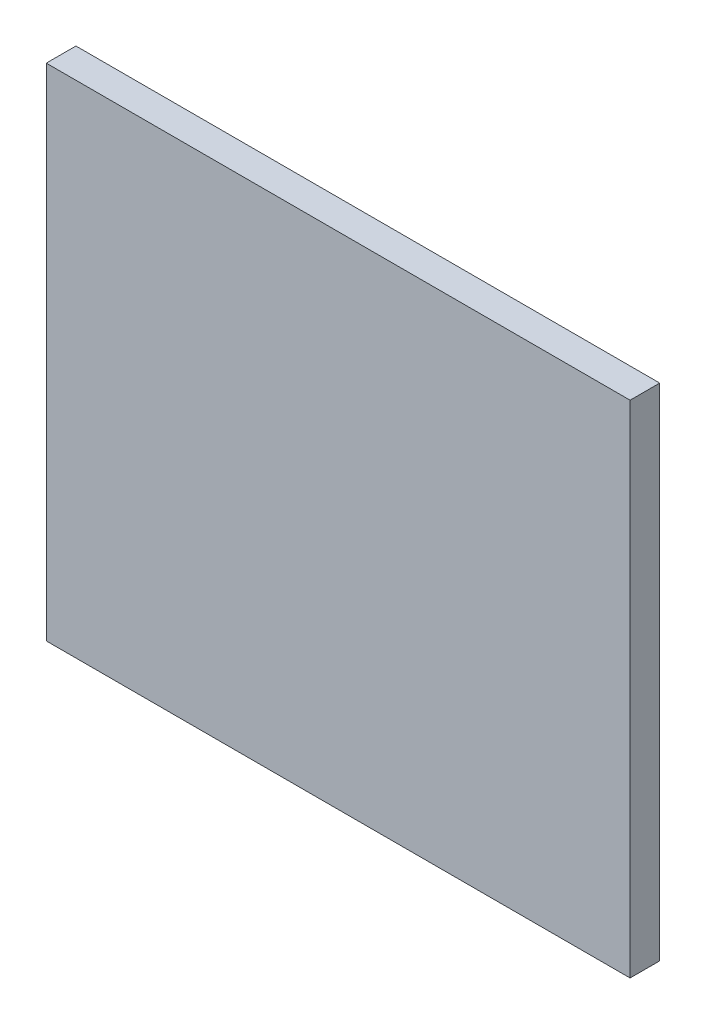
ISO-10303-21;
HEADER;
FILE_DESCRIPTION(('STEP AP214'),'2;1');
FILE_NAME('part.step','',(''),(''),'','','');
FILE_SCHEMA(('AUTOMOTIVE_DESIGN { 1 0 10303 214 1 1 1 1 }'));
ENDSEC;
DATA;
#1=APPLICATION_CONTEXT('core data for automotive mechanical design processes');
#2=APPLICATION_PROTOCOL_DEFINITION('international standard','automotive_design',2000,#1);
#3=PRODUCT_CONTEXT('',#1,'mechanical');
#4=PRODUCT('Part','Part','',(#3));
#5=PRODUCT_RELATED_PRODUCT_CATEGORY('part','',(#4));
#6=PRODUCT_DEFINITION_FORMATION('','',#4);
#7=PRODUCT_DEFINITION_CONTEXT('part definition',#1,'design');
#8=PRODUCT_DEFINITION('design','',#6,#7);
#9=PRODUCT_DEFINITION_SHAPE('','',#8);
#10=(LENGTH_UNIT() NAMED_UNIT(*) SI_UNIT(.MILLI.,.METRE.));
#11=(NAMED_UNIT(*) PLANE_ANGLE_UNIT() SI_UNIT($,.RADIAN.));
#12=(NAMED_UNIT(*) SI_UNIT($,.STERADIAN.) SOLID_ANGLE_UNIT());
#13=UNCERTAINTY_MEASURE_WITH_UNIT(LENGTH_MEASURE(1.E-05),#10,'distance_accuracy_value','');
#14=(GEOMETRIC_REPRESENTATION_CONTEXT(3) GLOBAL_UNCERTAINTY_ASSIGNED_CONTEXT((#13)) GLOBAL_UNIT_ASSIGNED_CONTEXT((#10,
#11,#12)) REPRESENTATION_CONTEXT('',''));
#15=CARTESIAN_POINT('',(0.,0.,0.));
#16=DIRECTION('',(0.,0.,1.));
#17=DIRECTION('',(1.,0.,0.));
#18=AXIS2_PLACEMENT_3D('',#15,#16,#17);
#19=CARTESIAN_POINT('',(97.9169998168945,85.3870010375977,0.));
#20=DIRECTION('',(0.,1.,0.));
#21=DIRECTION('',(1.,0.,0.));
#22=AXIS2_PLACEMENT_3D('',#19,#20,#21);
#23=PLANE('',#22);
#24=DIRECTION('',(1.,0.,0.));
#25=VECTOR('',#24,1.);
#26=CARTESIAN_POINT('',(97.9169998168945,85.3870010375977,0.03556));
#27=LINE('',#26,#25);
#28=CARTESIAN_POINT('',(97.9169998168945,85.3870010375977,0.03556));
#29=VERTEX_POINT('',#28);
#30=CARTESIAN_POINT('',(98.6169967651367,85.3870010375977,0.03556));
#31=VERTEX_POINT('',#30);
#32=EDGE_CURVE('E11',#29,#31,#27,.T.);
#33=ORIENTED_EDGE('',*,*,#32,.F.);
#34=DIRECTION('',(0.,0.,1.));
#35=VECTOR('',#34,1.);
#36=CARTESIAN_POINT('',(97.9169998168945,85.3870010375977,0.));
#37=LINE('',#36,#35);
#38=CARTESIAN_POINT('',(97.9169998168945,85.3870010375977,0.));
#39=VERTEX_POINT('',#38);
#40=EDGE_CURVE('E24',#39,#29,#37,.T.);
#41=ORIENTED_EDGE('',*,*,#40,.F.);
#42=DIRECTION('',(1.,0.,0.));
#43=VECTOR('',#42,1.);
#44=CARTESIAN_POINT('',(97.9169998168945,85.3870010375977,0.));
#45=LINE('',#44,#43);
#46=CARTESIAN_POINT('',(98.6169967651367,85.3870010375977,0.));
#47=VERTEX_POINT('',#46);
#48=EDGE_CURVE('E75',#39,#47,#45,.T.);
#49=ORIENTED_EDGE('',*,*,#48,.T.);
#50=DIRECTION('',(0.,0.,1.));
#51=VECTOR('',#50,1.);
#52=CARTESIAN_POINT('',(98.6169967651367,85.3870010375977,0.));
#53=LINE('',#52,#51);
#54=EDGE_CURVE('E37',#47,#31,#53,.T.);
#55=ORIENTED_EDGE('',*,*,#54,.T.);
#56=EDGE_LOOP('',(#33,#41,#49,#55));
#57=FACE_BOUND('',#56,.T.);
#58=ADVANCED_FACE('F17',(#57),#23,.F.);
#59=CARTESIAN_POINT('',(98.6169967651367,85.3870010375977,0.));
#60=DIRECTION('',(-1.,0.,0.));
#61=DIRECTION('',(0.,1.,0.));
#62=AXIS2_PLACEMENT_3D('',#59,#60,#61);
#63=PLANE('',#62);
#64=DIRECTION('',(0.,1.,0.));
#65=VECTOR('',#64,1.);
#66=CARTESIAN_POINT('',(98.6169967651367,85.3870010375977,0.03556));
#67=LINE('',#66,#65);
#68=CARTESIAN_POINT('',(98.6169967651367,85.9869995117188,0.03556));
#69=VERTEX_POINT('',#68);
#70=EDGE_CURVE('E83',#31,#69,#67,.T.);
#71=ORIENTED_EDGE('',*,*,#70,.F.);
#72=ORIENTED_EDGE('',*,*,#54,.F.);
#73=DIRECTION('',(0.,1.,0.));
#74=VECTOR('',#73,1.);
#75=CARTESIAN_POINT('',(98.6169967651367,85.3870010375977,0.));
#76=LINE('',#75,#74);
#77=CARTESIAN_POINT('',(98.6169967651367,85.9869995117188,0.));
#78=VERTEX_POINT('',#77);
#79=EDGE_CURVE('E81',#47,#78,#76,.T.);
#80=ORIENTED_EDGE('',*,*,#79,.T.);
#81=DIRECTION('',(0.,0.,1.));
#82=VECTOR('',#81,1.);
#83=CARTESIAN_POINT('',(98.6169967651367,85.9869995117188,0.));
#84=LINE('',#83,#82);
#85=EDGE_CURVE('E67',#78,#69,#84,.T.);
#86=ORIENTED_EDGE('',*,*,#85,.T.);
#87=EDGE_LOOP('',(#71,#72,#80,#86));
#88=FACE_BOUND('',#87,.T.);
#89=ADVANCED_FACE('F89',(#88),#63,.F.);
#90=CARTESIAN_POINT('',(98.6169967651367,85.9869995117188,0.));
#91=DIRECTION('',(0.,-1.,0.));
#92=DIRECTION('',(-1.,0.,0.));
#93=AXIS2_PLACEMENT_3D('',#90,#91,#92);
#94=PLANE('',#93);
#95=DIRECTION('',(-1.,0.,0.));
#96=VECTOR('',#95,1.);
#97=CARTESIAN_POINT('',(98.6169967651367,85.9869995117188,0.03556));
#98=LINE('',#97,#96);
#99=CARTESIAN_POINT('',(97.9169998168945,85.9869995117188,0.03556));
#100=VERTEX_POINT('',#99);
#101=EDGE_CURVE('E71',#69,#100,#98,.T.);
#102=ORIENTED_EDGE('',*,*,#101,.F.);
#103=ORIENTED_EDGE('',*,*,#85,.F.);
#104=DIRECTION('',(-1.,0.,0.));
#105=VECTOR('',#104,1.);
#106=CARTESIAN_POINT('',(98.6169967651367,85.9869995117188,0.));
#107=LINE('',#106,#105);
#108=CARTESIAN_POINT('',(97.9169998168945,85.9869995117188,0.));
#109=VERTEX_POINT('',#108);
#110=EDGE_CURVE('E63',#78,#109,#107,.T.);
#111=ORIENTED_EDGE('',*,*,#110,.T.);
#112=DIRECTION('',(0.,0.,1.));
#113=VECTOR('',#112,1.);
#114=CARTESIAN_POINT('',(97.9169998168945,85.9869995117188,0.));
#115=LINE('',#114,#113);
#116=EDGE_CURVE('E53',#109,#100,#115,.T.);
#117=ORIENTED_EDGE('',*,*,#116,.T.);
#118=EDGE_LOOP('',(#102,#103,#111,#117));
#119=FACE_BOUND('',#118,.T.);
#120=ADVANCED_FACE('F66',(#119),#94,.F.);
#121=CARTESIAN_POINT('',(97.9169998168945,85.9869995117188,0.));
#122=DIRECTION('',(1.,0.,0.));
#123=DIRECTION('',(0.,-1.,0.));
#124=AXIS2_PLACEMENT_3D('',#121,#122,#123);
#125=PLANE('',#124);
#126=DIRECTION('',(0.,-1.,0.));
#127=VECTOR('',#126,1.);
#128=CARTESIAN_POINT('',(97.9169998168945,85.9869995117188,0.03556));
#129=LINE('',#128,#127);
#130=EDGE_CURVE('E59',#100,#29,#129,.T.);
#131=ORIENTED_EDGE('',*,*,#130,.F.);
#132=ORIENTED_EDGE('',*,*,#116,.F.);
#133=DIRECTION('',(0.,-1.,0.));
#134=VECTOR('',#133,1.);
#135=CARTESIAN_POINT('',(97.9169998168945,85.9869995117188,0.));
#136=LINE('',#135,#134);
#137=EDGE_CURVE('E57',#109,#39,#136,.T.);
#138=ORIENTED_EDGE('',*,*,#137,.T.);
#139=ORIENTED_EDGE('',*,*,#40,.T.);
#140=EDGE_LOOP('',(#131,#132,#138,#139));
#141=FACE_BOUND('',#140,.T.);
#142=ADVANCED_FACE('F55',(#141),#125,.F.);
#143=CARTESIAN_POINT('',(97.9169998168945,85.3870010375977,0.));
#144=DIRECTION('',(0.,0.,-1.));
#145=DIRECTION('',(-1.,0.,0.));
#146=AXIS2_PLACEMENT_3D('',#143,#144,#145);
#147=PLANE('',#146);
#148=ORIENTED_EDGE('',*,*,#137,.F.);
#149=ORIENTED_EDGE('',*,*,#110,.F.);
#150=ORIENTED_EDGE('',*,*,#79,.F.);
#151=ORIENTED_EDGE('',*,*,#48,.F.);
#152=EDGE_LOOP('',(#148,#149,#150,#151));
#153=FACE_BOUND('',#152,.T.);
#154=ADVANCED_FACE('F74',(#153),#147,.T.);
#155=CARTESIAN_POINT('',(97.9169998168945,85.3870010375977,0.03556));
#156=DIRECTION('',(0.,0.,-1.));
#157=DIRECTION('',(-1.,0.,0.));
#158=AXIS2_PLACEMENT_3D('',#155,#156,#157);
#159=PLANE('',#158);
#160=ORIENTED_EDGE('',*,*,#32,.T.);
#161=ORIENTED_EDGE('',*,*,#70,.T.);
#162=ORIENTED_EDGE('',*,*,#101,.T.);
#163=ORIENTED_EDGE('',*,*,#130,.T.);
#164=EDGE_LOOP('',(#160,#161,#162,#163));
#165=FACE_BOUND('',#164,.T.);
#166=ADVANCED_FACE('F91',(#165),#159,.F.);
#167=CLOSED_SHELL('',(#58,#89,#120,#142,#154,#166));
#168=MANIFOLD_SOLID_BREP('B1',#167);
#169=ADVANCED_BREP_SHAPE_REPRESENTATION('',(#18,#168),#14);
#170=SHAPE_DEFINITION_REPRESENTATION(#9,#169);
ENDSEC;
END-ISO-10303-21;
